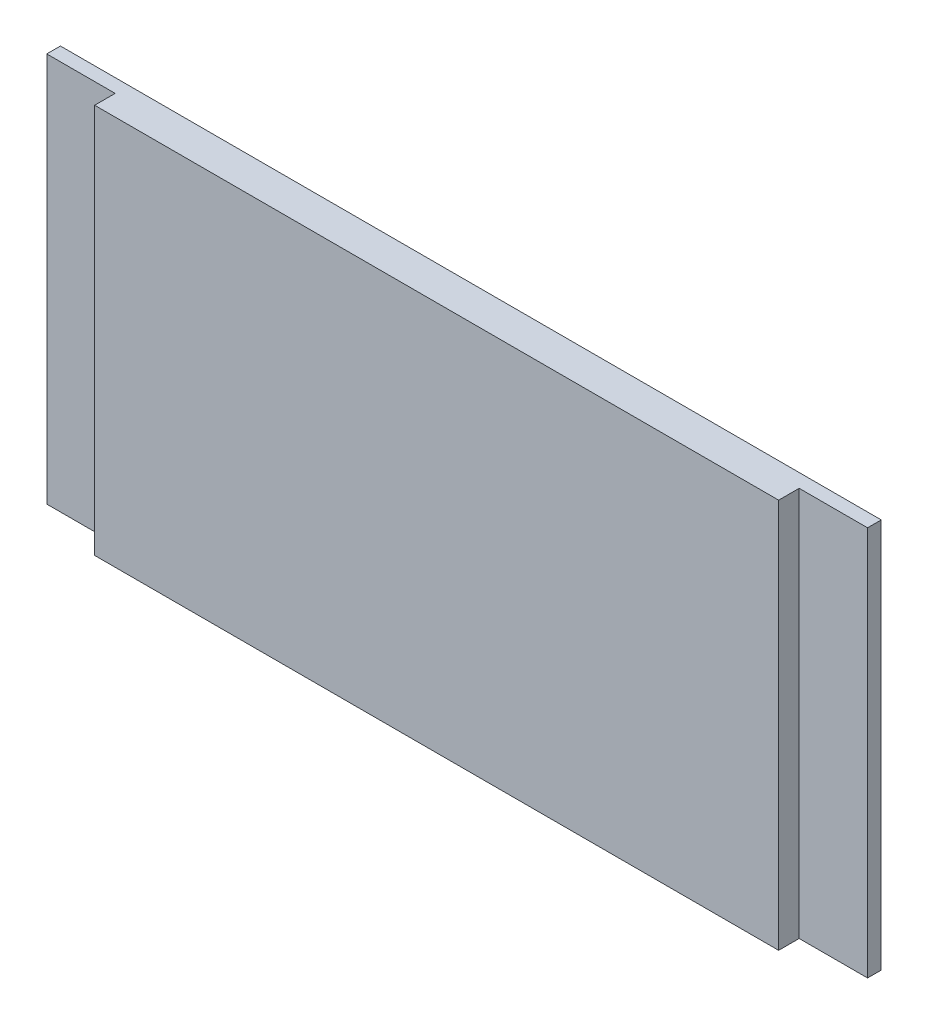
ISO-10303-21;
HEADER;
FILE_DESCRIPTION(('STEP AP214'),'2;1');
FILE_NAME('part.step','',(''),(''),'','','');
FILE_SCHEMA(('AUTOMOTIVE_DESIGN { 1 0 10303 214 1 1 1 1 }'));
ENDSEC;
DATA;
#1=APPLICATION_CONTEXT('core data for automotive mechanical design processes');
#2=APPLICATION_PROTOCOL_DEFINITION('international standard','automotive_design',2000,#1);
#3=PRODUCT_CONTEXT('',#1,'mechanical');
#4=PRODUCT('Part','Part','',(#3));
#5=PRODUCT_RELATED_PRODUCT_CATEGORY('part','',(#4));
#6=PRODUCT_DEFINITION_FORMATION('','',#4);
#7=PRODUCT_DEFINITION_CONTEXT('part definition',#1,'design');
#8=PRODUCT_DEFINITION('design','',#6,#7);
#9=PRODUCT_DEFINITION_SHAPE('','',#8);
#10=(LENGTH_UNIT() NAMED_UNIT(*) SI_UNIT(.MILLI.,.METRE.));
#11=(NAMED_UNIT(*) PLANE_ANGLE_UNIT() SI_UNIT($,.RADIAN.));
#12=(NAMED_UNIT(*) SI_UNIT($,.STERADIAN.) SOLID_ANGLE_UNIT());
#13=UNCERTAINTY_MEASURE_WITH_UNIT(LENGTH_MEASURE(1.E-05),#10,'distance_accuracy_value','');
#14=(GEOMETRIC_REPRESENTATION_CONTEXT(3) GLOBAL_UNCERTAINTY_ASSIGNED_CONTEXT((#13)) GLOBAL_UNIT_ASSIGNED_CONTEXT((#10,
#11,#12)) REPRESENTATION_CONTEXT('',''));
#15=CARTESIAN_POINT('',(0.,0.,0.));
#16=DIRECTION('',(0.,0.,1.));
#17=DIRECTION('',(1.,0.,0.));
#18=AXIS2_PLACEMENT_3D('',#15,#16,#17);
#19=CARTESIAN_POINT('',(0.,-28.5,5.));
#20=DIRECTION('',(0.,1.,0.));
#21=DIRECTION('',(0.,0.,1.));
#22=AXIS2_PLACEMENT_3D('',#19,#20,#21);
#23=PLANE('',#22);
#24=DIRECTION('',(1.,0.,0.));
#25=VECTOR('',#24,1.);
#26=CARTESIAN_POINT('',(0.,-28.5,0.));
#27=LINE('',#26,#25);
#28=CARTESIAN_POINT('',(-60.,-28.5,0.));
#29=VERTEX_POINT('',#28);
#30=CARTESIAN_POINT('',(60.,-28.5,0.));
#31=VERTEX_POINT('',#30);
#32=EDGE_CURVE('E134',#29,#31,#27,.T.);
#33=ORIENTED_EDGE('',*,*,#32,.T.);
#34=DIRECTION('',(0.,0.,-1.));
#35=VECTOR('',#34,1.);
#36=CARTESIAN_POINT('',(60.,-28.5,2.));
#37=LINE('',#36,#35);
#38=CARTESIAN_POINT('',(60.,-28.5,2.));
#39=VERTEX_POINT('',#38);
#40=EDGE_CURVE('E108',#39,#31,#37,.T.);
#41=ORIENTED_EDGE('',*,*,#40,.F.);
#42=DIRECTION('',(1.,0.,0.));
#43=VECTOR('',#42,1.);
#44=CARTESIAN_POINT('',(0.,-28.5,2.));
#45=LINE('',#44,#43);
#46=CARTESIAN_POINT('',(50.,-28.5,2.));
#47=VERTEX_POINT('',#46);
#48=EDGE_CURVE('E105',#47,#39,#45,.T.);
#49=ORIENTED_EDGE('',*,*,#48,.F.);
#50=DIRECTION('',(0.,0.,-1.));
#51=VECTOR('',#50,1.);
#52=CARTESIAN_POINT('',(50.,-28.5,5.));
#53=LINE('',#52,#51);
#54=CARTESIAN_POINT('',(50.,-28.5,5.));
#55=VERTEX_POINT('',#54);
#56=EDGE_CURVE('E11',#55,#47,#53,.T.);
#57=ORIENTED_EDGE('',*,*,#56,.F.);
#58=DIRECTION('',(1.,0.,0.));
#59=VECTOR('',#58,1.);
#60=CARTESIAN_POINT('',(0.,-28.5,5.));
#61=LINE('',#60,#59);
#62=CARTESIAN_POINT('',(-50.,-28.5,5.));
#63=VERTEX_POINT('',#62);
#64=EDGE_CURVE('E126',#63,#55,#61,.T.);
#65=ORIENTED_EDGE('',*,*,#64,.F.);
#66=DIRECTION('',(0.,0.,-1.));
#67=VECTOR('',#66,1.);
#68=CARTESIAN_POINT('',(-50.,-28.5,5.));
#69=LINE('',#68,#67);
#70=CARTESIAN_POINT('',(-50.,-28.5,2.));
#71=VERTEX_POINT('',#70);
#72=EDGE_CURVE('E142',#63,#71,#69,.T.);
#73=ORIENTED_EDGE('',*,*,#72,.T.);
#74=DIRECTION('',(1.,0.,0.));
#75=VECTOR('',#74,1.);
#76=CARTESIAN_POINT('',(0.,-28.5,2.));
#77=LINE('',#76,#75);
#78=CARTESIAN_POINT('',(-60.,-28.5,2.));
#79=VERTEX_POINT('',#78);
#80=EDGE_CURVE('E154',#79,#71,#77,.T.);
#81=ORIENTED_EDGE('',*,*,#80,.F.);
#82=DIRECTION('',(0.,0.,-1.));
#83=VECTOR('',#82,1.);
#84=CARTESIAN_POINT('',(-60.,-28.5,2.));
#85=LINE('',#84,#83);
#86=EDGE_CURVE('E171',#79,#29,#85,.T.);
#87=ORIENTED_EDGE('',*,*,#86,.T.);
#88=EDGE_LOOP('',(#33,#41,#49,#57,#65,#73,#81,#87));
#89=FACE_BOUND('',#88,.T.);
#90=ADVANCED_FACE('F40',(#89),#23,.F.);
#91=CARTESIAN_POINT('',(50.,0.,5.));
#92=DIRECTION('',(-1.,0.,0.));
#93=DIRECTION('',(0.,0.,1.));
#94=AXIS2_PLACEMENT_3D('',#91,#92,#93);
#95=PLANE('',#94);
#96=ORIENTED_EDGE('',*,*,#56,.T.);
#97=DIRECTION('',(0.,1.,0.));
#98=VECTOR('',#97,1.);
#99=CARTESIAN_POINT('',(50.,0.,2.));
#100=LINE('',#99,#98);
#101=CARTESIAN_POINT('',(50.,28.5,2.));
#102=VERTEX_POINT('',#101);
#103=EDGE_CURVE('E111',#47,#102,#100,.T.);
#104=ORIENTED_EDGE('',*,*,#103,.T.);
#105=DIRECTION('',(0.,0.,-1.));
#106=VECTOR('',#105,1.);
#107=CARTESIAN_POINT('',(50.,28.5,5.));
#108=LINE('',#107,#106);
#109=CARTESIAN_POINT('',(50.,28.5,5.));
#110=VERTEX_POINT('',#109);
#111=EDGE_CURVE('E47',#110,#102,#108,.T.);
#112=ORIENTED_EDGE('',*,*,#111,.F.);
#113=DIRECTION('',(0.,1.,0.));
#114=VECTOR('',#113,1.);
#115=CARTESIAN_POINT('',(50.,0.,5.));
#116=LINE('',#115,#114);
#117=EDGE_CURVE('E120',#55,#110,#116,.T.);
#118=ORIENTED_EDGE('',*,*,#117,.F.);
#119=EDGE_LOOP('',(#96,#104,#112,#118));
#120=FACE_BOUND('',#119,.T.);
#121=ADVANCED_FACE('F119',(#120),#95,.F.);
#122=CARTESIAN_POINT('',(0.,28.5,5.));
#123=DIRECTION('',(0.,1.,0.));
#124=DIRECTION('',(0.,0.,1.));
#125=AXIS2_PLACEMENT_3D('',#122,#123,#124);
#126=PLANE('',#125);
#127=DIRECTION('',(1.,0.,0.));
#128=VECTOR('',#127,1.);
#129=CARTESIAN_POINT('',(0.,28.5,0.));
#130=LINE('',#129,#128);
#131=CARTESIAN_POINT('',(-60.,28.5,0.));
#132=VERTEX_POINT('',#131);
#133=CARTESIAN_POINT('',(60.,28.5,0.));
#134=VERTEX_POINT('',#133);
#135=EDGE_CURVE('E132',#132,#134,#130,.T.);
#136=ORIENTED_EDGE('',*,*,#135,.F.);
#137=DIRECTION('',(0.,0.,-1.));
#138=VECTOR('',#137,1.);
#139=CARTESIAN_POINT('',(-60.,28.5,2.));
#140=LINE('',#139,#138);
#141=CARTESIAN_POINT('',(-60.,28.5,2.));
#142=VERTEX_POINT('',#141);
#143=EDGE_CURVE('E137',#142,#132,#140,.T.);
#144=ORIENTED_EDGE('',*,*,#143,.F.);
#145=DIRECTION('',(1.,0.,0.));
#146=VECTOR('',#145,1.);
#147=CARTESIAN_POINT('',(0.,28.5,2.));
#148=LINE('',#147,#146);
#149=CARTESIAN_POINT('',(-50.,28.5,2.));
#150=VERTEX_POINT('',#149);
#151=EDGE_CURVE('E163',#142,#150,#148,.T.);
#152=ORIENTED_EDGE('',*,*,#151,.T.);
#153=DIRECTION('',(0.,0.,-1.));
#154=VECTOR('',#153,1.);
#155=CARTESIAN_POINT('',(-50.,28.5,5.));
#156=LINE('',#155,#154);
#157=CARTESIAN_POINT('',(-50.,28.5,5.));
#158=VERTEX_POINT('',#157);
#159=EDGE_CURVE('E145',#158,#150,#156,.T.);
#160=ORIENTED_EDGE('',*,*,#159,.F.);
#161=DIRECTION('',(1.,0.,0.));
#162=VECTOR('',#161,1.);
#163=CARTESIAN_POINT('',(0.,28.5,5.));
#164=LINE('',#163,#162);
#165=EDGE_CURVE('E125',#158,#110,#164,.T.);
#166=ORIENTED_EDGE('',*,*,#165,.T.);
#167=ORIENTED_EDGE('',*,*,#111,.T.);
#168=DIRECTION('',(1.,0.,0.));
#169=VECTOR('',#168,1.);
#170=CARTESIAN_POINT('',(0.,28.5,2.));
#171=LINE('',#170,#169);
#172=CARTESIAN_POINT('',(60.,28.5,2.));
#173=VERTEX_POINT('',#172);
#174=EDGE_CURVE('E54',#102,#173,#171,.T.);
#175=ORIENTED_EDGE('',*,*,#174,.T.);
#176=DIRECTION('',(0.,0.,-1.));
#177=VECTOR('',#176,1.);
#178=CARTESIAN_POINT('',(60.,28.5,2.));
#179=LINE('',#178,#177);
#180=EDGE_CURVE('E183',#173,#134,#179,.T.);
#181=ORIENTED_EDGE('',*,*,#180,.T.);
#182=EDGE_LOOP('',(#136,#144,#152,#160,#166,#167,#175,#181));
#183=FACE_BOUND('',#182,.T.);
#184=ADVANCED_FACE('F147',(#183),#126,.T.);
#185=CARTESIAN_POINT('',(-50.,0.,5.));
#186=DIRECTION('',(-1.,0.,0.));
#187=DIRECTION('',(0.,0.,1.));
#188=AXIS2_PLACEMENT_3D('',#185,#186,#187);
#189=PLANE('',#188);
#190=DIRECTION('',(0.,1.,0.));
#191=VECTOR('',#190,1.);
#192=CARTESIAN_POINT('',(-50.,0.,2.));
#193=LINE('',#192,#191);
#194=EDGE_CURVE('E62',#71,#150,#193,.T.);
#195=ORIENTED_EDGE('',*,*,#194,.F.);
#196=ORIENTED_EDGE('',*,*,#72,.F.);
#197=DIRECTION('',(0.,1.,0.));
#198=VECTOR('',#197,1.);
#199=CARTESIAN_POINT('',(-50.,0.,5.));
#200=LINE('',#199,#198);
#201=EDGE_CURVE('E131',#63,#158,#200,.T.);
#202=ORIENTED_EDGE('',*,*,#201,.T.);
#203=ORIENTED_EDGE('',*,*,#159,.T.);
#204=EDGE_LOOP('',(#195,#196,#202,#203));
#205=FACE_BOUND('',#204,.T.);
#206=ADVANCED_FACE('F150',(#205),#189,.T.);
#207=CARTESIAN_POINT('',(0.,0.,5.));
#208=DIRECTION('',(0.,0.,1.));
#209=DIRECTION('',(1.,0.,0.));
#210=AXIS2_PLACEMENT_3D('',#207,#208,#209);
#211=PLANE('',#210);
#212=ORIENTED_EDGE('',*,*,#64,.T.);
#213=ORIENTED_EDGE('',*,*,#117,.T.);
#214=ORIENTED_EDGE('',*,*,#165,.F.);
#215=ORIENTED_EDGE('',*,*,#201,.F.);
#216=EDGE_LOOP('',(#212,#213,#214,#215));
#217=FACE_BOUND('',#216,.T.);
#218=ADVANCED_FACE('F129',(#217),#211,.T.);
#219=CARTESIAN_POINT('',(0.,0.,0.));
#220=DIRECTION('',(0.,0.,1.));
#221=DIRECTION('',(1.,0.,0.));
#222=AXIS2_PLACEMENT_3D('',#219,#220,#221);
#223=PLANE('',#222);
#224=ORIENTED_EDGE('',*,*,#32,.F.);
#225=DIRECTION('',(0.,1.,0.));
#226=VECTOR('',#225,1.);
#227=CARTESIAN_POINT('',(-60.,0.,0.));
#228=LINE('',#227,#226);
#229=EDGE_CURVE('E161',#29,#132,#228,.T.);
#230=ORIENTED_EDGE('',*,*,#229,.T.);
#231=ORIENTED_EDGE('',*,*,#135,.T.);
#232=DIRECTION('',(0.,1.,0.));
#233=VECTOR('',#232,1.);
#234=CARTESIAN_POINT('',(60.,0.,0.));
#235=LINE('',#234,#233);
#236=EDGE_CURVE('E117',#31,#134,#235,.T.);
#237=ORIENTED_EDGE('',*,*,#236,.F.);
#238=EDGE_LOOP('',(#224,#230,#231,#237));
#239=FACE_BOUND('',#238,.T.);
#240=ADVANCED_FACE('F177',(#239),#223,.F.);
#241=CARTESIAN_POINT('',(-60.,0.,2.));
#242=DIRECTION('',(-1.,0.,0.));
#243=DIRECTION('',(0.,0.,1.));
#244=AXIS2_PLACEMENT_3D('',#241,#242,#243);
#245=PLANE('',#244);
#246=ORIENTED_EDGE('',*,*,#229,.F.);
#247=ORIENTED_EDGE('',*,*,#86,.F.);
#248=DIRECTION('',(0.,1.,0.));
#249=VECTOR('',#248,1.);
#250=CARTESIAN_POINT('',(-60.,0.,2.));
#251=LINE('',#250,#249);
#252=EDGE_CURVE('E160',#79,#142,#251,.T.);
#253=ORIENTED_EDGE('',*,*,#252,.T.);
#254=ORIENTED_EDGE('',*,*,#143,.T.);
#255=EDGE_LOOP('',(#246,#247,#253,#254));
#256=FACE_BOUND('',#255,.T.);
#257=ADVANCED_FACE('F175',(#256),#245,.T.);
#258=CARTESIAN_POINT('',(0.,0.,2.));
#259=DIRECTION('',(0.,0.,1.));
#260=DIRECTION('',(1.,0.,0.));
#261=AXIS2_PLACEMENT_3D('',#258,#259,#260);
#262=PLANE('',#261);
#263=ORIENTED_EDGE('',*,*,#80,.T.);
#264=ORIENTED_EDGE('',*,*,#194,.T.);
#265=ORIENTED_EDGE('',*,*,#151,.F.);
#266=ORIENTED_EDGE('',*,*,#252,.F.);
#267=EDGE_LOOP('',(#263,#264,#265,#266));
#268=FACE_BOUND('',#267,.T.);
#269=ADVANCED_FACE('F157',(#268),#262,.T.);
#270=CARTESIAN_POINT('',(60.,0.,2.));
#271=DIRECTION('',(-1.,0.,0.));
#272=DIRECTION('',(0.,0.,1.));
#273=AXIS2_PLACEMENT_3D('',#270,#271,#272);
#274=PLANE('',#273);
#275=ORIENTED_EDGE('',*,*,#236,.T.);
#276=ORIENTED_EDGE('',*,*,#180,.F.);
#277=DIRECTION('',(0.,1.,0.));
#278=VECTOR('',#277,1.);
#279=CARTESIAN_POINT('',(60.,0.,2.));
#280=LINE('',#279,#278);
#281=EDGE_CURVE('E110',#39,#173,#280,.T.);
#282=ORIENTED_EDGE('',*,*,#281,.F.);
#283=ORIENTED_EDGE('',*,*,#40,.T.);
#284=EDGE_LOOP('',(#275,#276,#282,#283));
#285=FACE_BOUND('',#284,.T.);
#286=ADVANCED_FACE('F181',(#285),#274,.F.);
#287=CARTESIAN_POINT('',(0.,0.,2.));
#288=DIRECTION('',(0.,0.,1.));
#289=DIRECTION('',(1.,0.,0.));
#290=AXIS2_PLACEMENT_3D('',#287,#288,#289);
#291=PLANE('',#290);
#292=ORIENTED_EDGE('',*,*,#103,.F.);
#293=ORIENTED_EDGE('',*,*,#48,.T.);
#294=ORIENTED_EDGE('',*,*,#281,.T.);
#295=ORIENTED_EDGE('',*,*,#174,.F.);
#296=EDGE_LOOP('',(#292,#293,#294,#295));
#297=FACE_BOUND('',#296,.T.);
#298=ADVANCED_FACE('F113',(#297),#291,.T.);
#299=CLOSED_SHELL('',(#90,#121,#184,#206,#218,#240,#257,#269,#286,#298));
#300=MANIFOLD_SOLID_BREP('B2',#299);
#301=ADVANCED_BREP_SHAPE_REPRESENTATION('',(#18,#300),#14);
#302=SHAPE_DEFINITION_REPRESENTATION(#9,#301);
ENDSEC;
END-ISO-10303-21;
